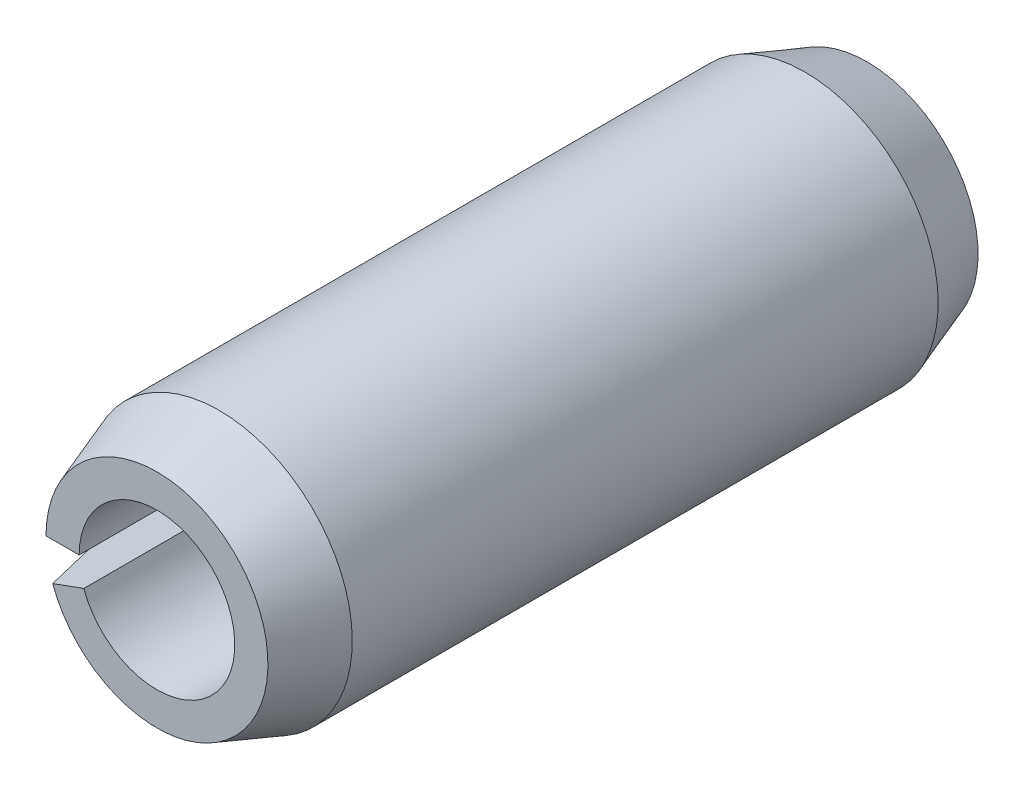
ISO-10303-21;
HEADER;
FILE_DESCRIPTION(('STEP AP214'),'2;1');
FILE_NAME('part.step','',(''),(''),'','','');
FILE_SCHEMA(('AUTOMOTIVE_DESIGN { 1 0 10303 214 1 1 1 1 }'));
ENDSEC;
DATA;
#1=APPLICATION_CONTEXT('core data for automotive mechanical design processes');
#2=APPLICATION_PROTOCOL_DEFINITION('international standard','automotive_design',2000,#1);
#3=PRODUCT_CONTEXT('',#1,'mechanical');
#4=PRODUCT('Part','Part','',(#3));
#5=PRODUCT_RELATED_PRODUCT_CATEGORY('part','',(#4));
#6=PRODUCT_DEFINITION_FORMATION('','',#4);
#7=PRODUCT_DEFINITION_CONTEXT('part definition',#1,'design');
#8=PRODUCT_DEFINITION('design','',#6,#7);
#9=PRODUCT_DEFINITION_SHAPE('','',#8);
#10=(LENGTH_UNIT() NAMED_UNIT(*) SI_UNIT(.MILLI.,.METRE.));
#11=(NAMED_UNIT(*) PLANE_ANGLE_UNIT() SI_UNIT($,.RADIAN.));
#12=(NAMED_UNIT(*) SI_UNIT($,.STERADIAN.) SOLID_ANGLE_UNIT());
#13=UNCERTAINTY_MEASURE_WITH_UNIT(LENGTH_MEASURE(1.E-05),#10,'distance_accuracy_value','');
#14=(GEOMETRIC_REPRESENTATION_CONTEXT(3) GLOBAL_UNCERTAINTY_ASSIGNED_CONTEXT((#13)) GLOBAL_UNIT_ASSIGNED_CONTEXT((#10,
#11,#12)) REPRESENTATION_CONTEXT('',''));
#15=CARTESIAN_POINT('',(0.,0.,0.));
#16=DIRECTION('',(0.,0.,1.));
#17=DIRECTION('',(1.,0.,0.));
#18=AXIS2_PLACEMENT_3D('',#15,#16,#17);
#19=CARTESIAN_POINT('',(-1.25,0.,8.));
#20=DIRECTION('',(0.,0.,1.));
#21=DIRECTION('',(1.,0.,0.));
#22=AXIS2_PLACEMENT_3D('',#19,#20,#21);
#23=PLANE('',#22);
#24=DIRECTION('',(-0.93969262078591,-0.342020143325665,0.));
#25=VECTOR('',#24,1.);
#26=CARTESIAN_POINT('',(-0.823935238988265,-0.299887901954738,8.));
#27=LINE('',#26,#25);
#28=CARTESIAN_POINT('',(-0.823935238988265,-0.299887901954738,8.));
#29=VERTEX_POINT('',#28);
#30=CARTESIAN_POINT('',(-1.1746157759685,-0.427525179152031,8.0000000000191));
#31=VERTEX_POINT('',#30);
#32=EDGE_CURVE('E82',#29,#31,#27,.T.);
#33=ORIENTED_EDGE('',*,*,#32,.T.);
#34=CARTESIAN_POINT('',(0.,0.,8.0000000000382));
#35=DIRECTION('',(0.,0.,-1.));
#36=DIRECTION('',(-1.,0.,0.));
#37=AXIS2_PLACEMENT_3D('',#34,#35,#36);
#38=CIRCLE('',#37,1.24999999997044);
#39=CARTESIAN_POINT('',(-1.24999999997631,0.,8.00000000002865));
#40=VERTEX_POINT('',#39);
#41=EDGE_CURVE('E70',#40,#31,#38,.T.);
#42=ORIENTED_EDGE('',*,*,#41,.F.);
#43=DIRECTION('',(1.,0.,0.));
#44=VECTOR('',#43,1.);
#45=CARTESIAN_POINT('',(-1.17342807180984,0.,8.));
#46=LINE('',#45,#44);
#47=CARTESIAN_POINT('',(-0.876813567290941,0.,8.));
#48=VERTEX_POINT('',#47);
#49=EDGE_CURVE('E66',#40,#48,#46,.T.);
#50=ORIENTED_EDGE('',*,*,#49,.T.);
#51=CARTESIAN_POINT('',(0.,0.,8.));
#52=DIRECTION('',(0.,0.,-1.));
#53=DIRECTION('',(-1.,0.,0.));
#54=AXIS2_PLACEMENT_3D('',#51,#52,#53);
#55=CIRCLE('',#54,0.876813567290941);
#56=EDGE_CURVE('E19',#48,#29,#55,.T.);
#57=ORIENTED_EDGE('',*,*,#56,.T.);
#58=EDGE_LOOP('',(#33,#42,#50,#57));
#59=FACE_BOUND('',#58,.T.);
#60=ADVANCED_FACE('F16',(#59),#23,.T.);
#61=CARTESIAN_POINT('',(0.,0.,4.));
#62=DIRECTION('',(0.,0.,-1.));
#63=DIRECTION('',(-1.,0.,0.));
#64=AXIS2_PLACEMENT_3D('',#61,#62,#63);
#65=CYLINDRICAL_SURFACE('',#64,0.876813567290941);
#66=CARTESIAN_POINT('',(0.,0.,0.));
#67=DIRECTION('',(0.,0.,-1.));
#68=DIRECTION('',(-1.,0.,0.));
#69=AXIS2_PLACEMENT_3D('',#66,#67,#68);
#70=CIRCLE('',#69,0.876813567290941);
#71=CARTESIAN_POINT('',(-0.823935238988266,-0.299887901954738,0.));
#72=VERTEX_POINT('',#71);
#73=CARTESIAN_POINT('',(-0.876813567290941,0.,0.));
#74=VERTEX_POINT('',#73);
#75=EDGE_CURVE('E75',#72,#74,#70,.F.);
#76=ORIENTED_EDGE('',*,*,#75,.F.);
#77=DIRECTION('',(0.,0.,1.));
#78=VECTOR('',#77,1.);
#79=CARTESIAN_POINT('',(-0.823935238988265,-0.299887901954737,4.));
#80=LINE('',#79,#78);
#81=EDGE_CURVE('E81',#29,#72,#80,.F.);
#82=ORIENTED_EDGE('',*,*,#81,.F.);
#83=ORIENTED_EDGE('',*,*,#56,.F.);
#84=DIRECTION('',(0.,0.,1.));
#85=VECTOR('',#84,1.);
#86=CARTESIAN_POINT('',(-0.876813567290941,0.,4.));
#87=LINE('',#86,#85);
#88=EDGE_CURVE('E74',#48,#74,#87,.F.);
#89=ORIENTED_EDGE('',*,*,#88,.T.);
#90=EDGE_LOOP('',(#76,#82,#83,#89));
#91=FACE_BOUND('',#90,.T.);
#92=ADVANCED_FACE('F78',(#91),#65,.F.);
#93=CARTESIAN_POINT('',(-0.876813567290942,0.,0.));
#94=DIRECTION('',(0.,0.,-1.));
#95=DIRECTION('',(-1.,0.,0.));
#96=AXIS2_PLACEMENT_3D('',#93,#94,#95);
#97=PLANE('',#96);
#98=DIRECTION('',(-0.939692620785908,-0.342020143325669,0.));
#99=VECTOR('',#98,1.);
#100=CARTESIAN_POINT('',(-1.10266170010275,-0.401336037302766,0.));
#101=LINE('',#100,#99);
#102=CARTESIAN_POINT('',(-1.17461577598999,-0.42752517916067,4.2632564145606E-11));
#103=VERTEX_POINT('',#102);
#104=EDGE_CURVE('E103',#72,#103,#101,.T.);
#105=ORIENTED_EDGE('',*,*,#104,.F.);
#106=ORIENTED_EDGE('',*,*,#75,.T.);
#107=DIRECTION('',(1.,0.,0.));
#108=VECTOR('',#107,1.);
#109=CARTESIAN_POINT('',(-1.17342807180984,0.,0.));
#110=LINE('',#109,#108);
#111=CARTESIAN_POINT('',(-1.24999999999763,0.,4.2632564145606E-11));
#112=VERTEX_POINT('',#111);
#113=EDGE_CURVE('E86',#74,#112,#110,.F.);
#114=ORIENTED_EDGE('',*,*,#113,.T.);
#115=CARTESIAN_POINT('',(0.,0.,5.6843418860808E-11));
#116=DIRECTION('',(0.,0.,1.));
#117=DIRECTION('',(1.,0.,0.));
#118=AXIS2_PLACEMENT_3D('',#115,#116,#117);
#119=CIRCLE('',#118,1.24999999999886);
#120=EDGE_CURVE('E94',#103,#112,#119,.T.);
#121=ORIENTED_EDGE('',*,*,#120,.F.);
#122=EDGE_LOOP('',(#105,#106,#114,#121));
#123=FACE_BOUND('',#122,.T.);
#124=ADVANCED_FACE('F101',(#123),#97,.T.);
#125=CARTESIAN_POINT('',(-1.17342807180984,0.,4.));
#126=DIRECTION('',(0.,1.,0.));
#127=DIRECTION('',(0.,0.,1.));
#128=AXIS2_PLACEMENT_3D('',#125,#126,#127);
#129=PLANE('',#128);
#130=DIRECTION('',(0.,0.,-1.));
#131=VECTOR('',#130,1.);
#132=CARTESIAN_POINT('',(-1.5,0.,4.));
#133=LINE('',#132,#131);
#134=CARTESIAN_POINT('',(-1.49999999998226,0.,0.699999999997408));
#135=VERTEX_POINT('',#134);
#136=CARTESIAN_POINT('',(-1.49999999999648,0.,7.29999999999159));
#137=VERTEX_POINT('',#136);
#138=EDGE_CURVE('E97',#135,#137,#133,.F.);
#139=ORIENTED_EDGE('',*,*,#138,.F.);
#140=DIRECTION('',(0.336336396999206,0.,-0.941741911594463));
#141=VECTOR('',#140,1.);
#142=CARTESIAN_POINT('',(-178215.535714913,0.,499000.));
#143=LINE('',#142,#141);
#144=EDGE_CURVE('E104',#112,#135,#143,.F.);
#145=ORIENTED_EDGE('',*,*,#144,.F.);
#146=ORIENTED_EDGE('',*,*,#113,.F.);
#147=ORIENTED_EDGE('',*,*,#88,.F.);
#148=ORIENTED_EDGE('',*,*,#49,.F.);
#149=DIRECTION('',(0.336336396999206,0.,0.941741911594463));
#150=VECTOR('',#149,1.);
#151=CARTESIAN_POINT('',(-178218.39285777,0.,-499000.));
#152=LINE('',#151,#150);
#153=EDGE_CURVE('E88',#137,#40,#152,.T.);
#154=ORIENTED_EDGE('',*,*,#153,.F.);
#155=EDGE_LOOP('',(#139,#145,#146,#147,#148,#154));
#156=FACE_BOUND('',#155,.T.);
#157=ADVANCED_FACE('F84',(#156),#129,.F.);
#158=CARTESIAN_POINT('',(0.,0.,7.29999999998654));
#159=DIRECTION('',(0.,0.,-1.));
#160=DIRECTION('',(-1.,0.,0.));
#161=AXIS2_PLACEMENT_3D('',#158,#159,#160);
#162=CONICAL_SURFACE('',#161,1.49999999999295,0.343023940425848);
#163=DIRECTION('',(0.31605283036088,0.115033822706946,0.94174191159484));
#164=VECTOR('',#163,1.);
#165=CARTESIAN_POINT('',(-1.40953893117886,-0.513030214988502,7.3));
#166=LINE('',#165,#164);
#167=CARTESIAN_POINT('',(-1.40953893117472,-0.513030214985391,7.29999999999327));
#168=VERTEX_POINT('',#167);
#169=EDGE_CURVE('E98',#168,#31,#166,.T.);
#170=ORIENTED_EDGE('',*,*,#169,.F.);
#171=CARTESIAN_POINT('',(0.,0.,7.3));
#172=DIRECTION('',(0.,0.,-1.));
#173=DIRECTION('',(-1.,0.,0.));
#174=AXIS2_PLACEMENT_3D('',#171,#172,#173);
#175=CIRCLE('',#174,1.5);
#176=EDGE_CURVE('E118',#137,#168,#175,.T.);
#177=ORIENTED_EDGE('',*,*,#176,.F.);
#178=ORIENTED_EDGE('',*,*,#153,.T.);
#179=ORIENTED_EDGE('',*,*,#41,.T.);
#180=EDGE_LOOP('',(#170,#177,#178,#179));
#181=FACE_BOUND('',#180,.T.);
#182=ADVANCED_FACE('F140',(#181),#162,.T.);
#183=CARTESIAN_POINT('',(-1.10266170010275,-0.401336037302766,4.));
#184=DIRECTION('',(-0.342020143325669,0.939692620785908,0.));
#185=DIRECTION('',(-0.939692620785908,-0.342020143325669,0.));
#186=AXIS2_PLACEMENT_3D('',#183,#184,#185);
#187=PLANE('',#186);
#188=DIRECTION('',(0.316052830361873,0.115033822707308,-0.941741911594463));
#189=VECTOR('',#188,1.);
#190=CARTESIAN_POINT('',(-167467.823820711,-60953.3030680754,499000.));
#191=LINE('',#190,#189);
#192=CARTESIAN_POINT('',(-1.40953893117057,-0.51303021498228,0.699999999994816));
#193=VERTEX_POINT('',#192);
#194=EDGE_CURVE('E34',#193,#103,#191,.T.);
#195=ORIENTED_EDGE('',*,*,#194,.F.);
#196=DIRECTION('',(0.,0.,-1.));
#197=VECTOR('',#196,1.);
#198=CARTESIAN_POINT('',(-1.40953893117886,-0.513030214988504,4.));
#199=LINE('',#198,#197);
#200=EDGE_CURVE('E25',#168,#193,#199,.T.);
#201=ORIENTED_EDGE('',*,*,#200,.F.);
#202=ORIENTED_EDGE('',*,*,#169,.T.);
#203=ORIENTED_EDGE('',*,*,#32,.F.);
#204=ORIENTED_EDGE('',*,*,#81,.T.);
#205=ORIENTED_EDGE('',*,*,#104,.T.);
#206=EDGE_LOOP('',(#195,#201,#202,#203,#204,#205));
#207=FACE_BOUND('',#206,.T.);
#208=ADVANCED_FACE('F107',(#207),#187,.T.);
#209=CARTESIAN_POINT('',(0.,0.,0.699999999994816));
#210=DIRECTION('',(0.,0.,1.));
#211=DIRECTION('',(1.,0.,0.));
#212=AXIS2_PLACEMENT_3D('',#209,#210,#211);
#213=CONICAL_SURFACE('',#212,1.49999999996453,0.343023940405271);
#214=ORIENTED_EDGE('',*,*,#194,.T.);
#215=ORIENTED_EDGE('',*,*,#120,.T.);
#216=ORIENTED_EDGE('',*,*,#144,.T.);
#217=CARTESIAN_POINT('',(0.,0.,0.7));
#218=DIRECTION('',(0.,0.,-1.));
#219=DIRECTION('',(-1.,0.,0.));
#220=AXIS2_PLACEMENT_3D('',#217,#218,#219);
#221=CIRCLE('',#220,1.5);
#222=EDGE_CURVE('E11',#193,#135,#221,.F.);
#223=ORIENTED_EDGE('',*,*,#222,.F.);
#224=EDGE_LOOP('',(#214,#215,#216,#223));
#225=FACE_BOUND('',#224,.T.);
#226=ADVANCED_FACE('F137',(#225),#213,.T.);
#227=CARTESIAN_POINT('',(0.,0.,4.));
#228=DIRECTION('',(0.,0.,-1.));
#229=DIRECTION('',(-1.,0.,0.));
#230=AXIS2_PLACEMENT_3D('',#227,#228,#229);
#231=CYLINDRICAL_SURFACE('',#230,1.5);
#232=ORIENTED_EDGE('',*,*,#200,.T.);
#233=ORIENTED_EDGE('',*,*,#222,.T.);
#234=ORIENTED_EDGE('',*,*,#138,.T.);
#235=ORIENTED_EDGE('',*,*,#176,.T.);
#236=EDGE_LOOP('',(#232,#233,#234,#235));
#237=FACE_BOUND('',#236,.T.);
#238=ADVANCED_FACE('F138',(#237),#231,.T.);
#239=CLOSED_SHELL('',(#60,#92,#124,#157,#182,#208,#226,#238));
#240=MANIFOLD_SOLID_BREP('B1',#239);
#241=ADVANCED_BREP_SHAPE_REPRESENTATION('',(#18,#240),#14);
#242=SHAPE_DEFINITION_REPRESENTATION(#9,#241);
ENDSEC;
END-ISO-10303-21;
